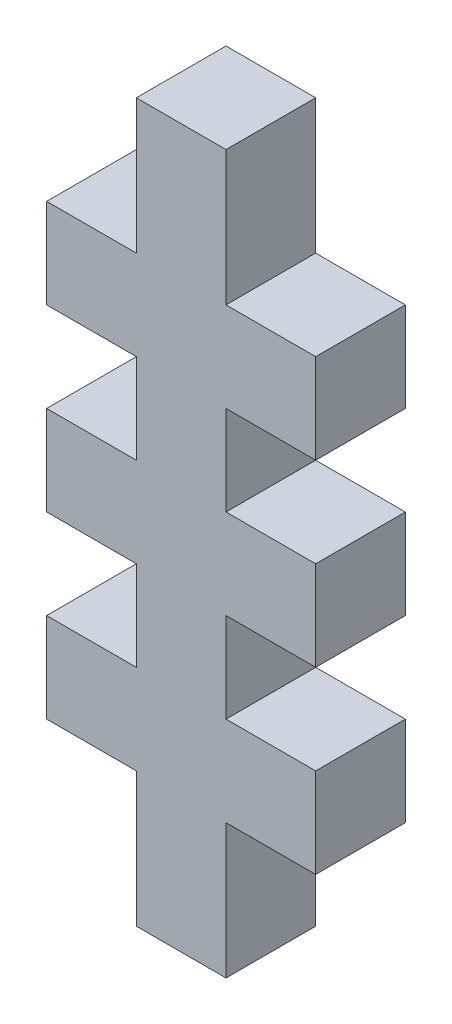
ISO-10303-21;
HEADER;
FILE_DESCRIPTION(('STEP AP214'),'2;1');
FILE_NAME('part.step','',(''),(''),'','','');
FILE_SCHEMA(('AUTOMOTIVE_DESIGN { 1 0 10303 214 1 1 1 1 }'));
ENDSEC;
DATA;
#1=APPLICATION_CONTEXT('core data for automotive mechanical design processes');
#2=APPLICATION_PROTOCOL_DEFINITION('international standard','automotive_design',2000,#1);
#3=PRODUCT_CONTEXT('',#1,'mechanical');
#4=PRODUCT('Part','Part','',(#3));
#5=PRODUCT_RELATED_PRODUCT_CATEGORY('part','',(#4));
#6=PRODUCT_DEFINITION_FORMATION('','',#4);
#7=PRODUCT_DEFINITION_CONTEXT('part definition',#1,'design');
#8=PRODUCT_DEFINITION('design','',#6,#7);
#9=PRODUCT_DEFINITION_SHAPE('','',#8);
#10=(LENGTH_UNIT() NAMED_UNIT(*) SI_UNIT(.MILLI.,.METRE.));
#11=(NAMED_UNIT(*) PLANE_ANGLE_UNIT() SI_UNIT($,.RADIAN.));
#12=(NAMED_UNIT(*) SI_UNIT($,.STERADIAN.) SOLID_ANGLE_UNIT());
#13=UNCERTAINTY_MEASURE_WITH_UNIT(LENGTH_MEASURE(1.E-05),#10,'distance_accuracy_value','');
#14=(GEOMETRIC_REPRESENTATION_CONTEXT(3) GLOBAL_UNCERTAINTY_ASSIGNED_CONTEXT((#13)) GLOBAL_UNIT_ASSIGNED_CONTEXT((#10,
#11,#12)) REPRESENTATION_CONTEXT('',''));
#15=CARTESIAN_POINT('',(0.,0.,0.));
#16=DIRECTION('',(0.,0.,1.));
#17=DIRECTION('',(1.,0.,0.));
#18=AXIS2_PLACEMENT_3D('',#15,#16,#17);
#19=CARTESIAN_POINT('',(7.5,20.,5.));
#20=DIRECTION('',(-1.,0.,0.));
#21=DIRECTION('',(0.,-1.,0.));
#22=AXIS2_PLACEMENT_3D('',#19,#20,#21);
#23=PLANE('',#22);
#24=DIRECTION('',(0.,1.,0.));
#25=VECTOR('',#24,1.);
#26=CARTESIAN_POINT('',(7.5,20.,0.));
#27=LINE('',#26,#25);
#28=CARTESIAN_POINT('',(7.5,-12.5,0.));
#29=VERTEX_POINT('',#28);
#30=CARTESIAN_POINT('',(7.5,-7.5,0.));
#31=VERTEX_POINT('',#30);
#32=EDGE_CURVE('E420',#29,#31,#27,.T.);
#33=ORIENTED_EDGE('',*,*,#32,.T.);
#34=DIRECTION('',(0.,0.,1.));
#35=VECTOR('',#34,1.);
#36=CARTESIAN_POINT('',(7.5,-7.5,0.));
#37=LINE('',#36,#35);
#38=CARTESIAN_POINT('',(7.5,-7.5,5.));
#39=VERTEX_POINT('',#38);
#40=EDGE_CURVE('E248',#31,#39,#37,.T.);
#41=ORIENTED_EDGE('',*,*,#40,.T.);
#42=DIRECTION('',(0.,1.,0.));
#43=VECTOR('',#42,1.);
#44=CARTESIAN_POINT('',(7.5,20.,5.));
#45=LINE('',#44,#43);
#46=CARTESIAN_POINT('',(7.5,-12.5,5.));
#47=VERTEX_POINT('',#46);
#48=EDGE_CURVE('E41',#47,#39,#45,.T.);
#49=ORIENTED_EDGE('',*,*,#48,.F.);
#50=DIRECTION('',(0.,0.,-1.));
#51=VECTOR('',#50,1.);
#52=CARTESIAN_POINT('',(7.5,-12.5,5.));
#53=LINE('',#52,#51);
#54=EDGE_CURVE('E340',#47,#29,#53,.T.);
#55=ORIENTED_EDGE('',*,*,#54,.T.);
#56=EDGE_LOOP('',(#33,#41,#49,#55));
#57=FACE_BOUND('',#56,.T.);
#58=ADVANCED_FACE('F32',(#57),#23,.F.);
#59=CARTESIAN_POINT('',(0.,0.,5.));
#60=DIRECTION('',(0.,0.,1.));
#61=DIRECTION('',(1.,0.,0.));
#62=AXIS2_PLACEMENT_3D('',#59,#60,#61);
#63=PLANE('',#62);
#64=DIRECTION('',(1.,0.,0.));
#65=VECTOR('',#64,1.);
#66=CARTESIAN_POINT('',(7.5,-7.5,5.));
#67=LINE('',#66,#65);
#68=CARTESIAN_POINT('',(2.5,-7.5,5.));
#69=VERTEX_POINT('',#68);
#70=EDGE_CURVE('E240',#69,#39,#67,.T.);
#71=ORIENTED_EDGE('',*,*,#70,.F.);
#72=DIRECTION('',(0.,-1.,0.));
#73=VECTOR('',#72,1.);
#74=CARTESIAN_POINT('',(2.5,-7.5,5.));
#75=LINE('',#74,#73);
#76=CARTESIAN_POINT('',(2.5,-2.5,5.));
#77=VERTEX_POINT('',#76);
#78=EDGE_CURVE('E242',#77,#69,#75,.T.);
#79=ORIENTED_EDGE('',*,*,#78,.F.);
#80=DIRECTION('',(-1.,0.,0.));
#81=VECTOR('',#80,1.);
#82=CARTESIAN_POINT('',(7.5,-2.5,5.));
#83=LINE('',#82,#81);
#84=CARTESIAN_POINT('',(7.5,-2.5,5.));
#85=VERTEX_POINT('',#84);
#86=EDGE_CURVE('E221',#85,#77,#83,.T.);
#87=ORIENTED_EDGE('',*,*,#86,.F.);
#88=CARTESIAN_POINT('',(7.5,2.5,5.));
#89=VERTEX_POINT('',#88);
#90=EDGE_CURVE('E411',#85,#89,#45,.T.);
#91=ORIENTED_EDGE('',*,*,#90,.T.);
#92=DIRECTION('',(-1.,0.,0.));
#93=VECTOR('',#92,1.);
#94=CARTESIAN_POINT('',(7.5,2.5,5.));
#95=LINE('',#94,#93);
#96=CARTESIAN_POINT('',(2.5,2.5,5.));
#97=VERTEX_POINT('',#96);
#98=EDGE_CURVE('E256',#89,#97,#95,.T.);
#99=ORIENTED_EDGE('',*,*,#98,.T.);
#100=DIRECTION('',(0.,1.,0.));
#101=VECTOR('',#100,1.);
#102=CARTESIAN_POINT('',(2.5,7.5,5.));
#103=LINE('',#102,#101);
#104=CARTESIAN_POINT('',(2.5,7.5,5.));
#105=VERTEX_POINT('',#104);
#106=EDGE_CURVE('E263',#97,#105,#103,.T.);
#107=ORIENTED_EDGE('',*,*,#106,.T.);
#108=DIRECTION('',(1.,0.,0.));
#109=VECTOR('',#108,1.);
#110=CARTESIAN_POINT('',(7.5,7.5,5.));
#111=LINE('',#110,#109);
#112=CARTESIAN_POINT('',(7.5,7.5,5.));
#113=VERTEX_POINT('',#112);
#114=EDGE_CURVE('E251',#105,#113,#111,.T.);
#115=ORIENTED_EDGE('',*,*,#114,.T.);
#116=CARTESIAN_POINT('',(7.5,12.5,5.));
#117=VERTEX_POINT('',#116);
#118=EDGE_CURVE('E409',#113,#117,#45,.T.);
#119=ORIENTED_EDGE('',*,*,#118,.T.);
#120=DIRECTION('',(-1.,0.,0.));
#121=VECTOR('',#120,1.);
#122=CARTESIAN_POINT('',(7.5,12.5,5.));
#123=LINE('',#122,#121);
#124=CARTESIAN_POINT('',(2.5,12.5,5.));
#125=VERTEX_POINT('',#124);
#126=EDGE_CURVE('E347',#117,#125,#123,.T.);
#127=ORIENTED_EDGE('',*,*,#126,.T.);
#128=DIRECTION('',(0.,1.,0.));
#129=VECTOR('',#128,1.);
#130=CARTESIAN_POINT('',(2.5,20.,5.));
#131=LINE('',#130,#129);
#132=CARTESIAN_POINT('',(2.5,20.,5.));
#133=VERTEX_POINT('',#132);
#134=EDGE_CURVE('E344',#125,#133,#131,.T.);
#135=ORIENTED_EDGE('',*,*,#134,.T.);
#136=DIRECTION('',(-1.,0.,0.));
#137=VECTOR('',#136,1.);
#138=CARTESIAN_POINT('',(-7.5,20.,5.));
#139=LINE('',#138,#137);
#140=CARTESIAN_POINT('',(-2.5,20.,5.));
#141=VERTEX_POINT('',#140);
#142=EDGE_CURVE('E11',#133,#141,#139,.T.);
#143=ORIENTED_EDGE('',*,*,#142,.T.);
#144=DIRECTION('',(0.,1.,0.));
#145=VECTOR('',#144,1.);
#146=CARTESIAN_POINT('',(-2.5,20.,5.));
#147=LINE('',#146,#145);
#148=CARTESIAN_POINT('',(-2.5,12.5,5.));
#149=VERTEX_POINT('',#148);
#150=EDGE_CURVE('E384',#149,#141,#147,.T.);
#151=ORIENTED_EDGE('',*,*,#150,.F.);
#152=DIRECTION('',(1.,0.,0.));
#153=VECTOR('',#152,1.);
#154=CARTESIAN_POINT('',(-7.5,12.5,5.));
#155=LINE('',#154,#153);
#156=CARTESIAN_POINT('',(-7.5,12.5,5.));
#157=VERTEX_POINT('',#156);
#158=EDGE_CURVE('E382',#157,#149,#155,.T.);
#159=ORIENTED_EDGE('',*,*,#158,.F.);
#160=DIRECTION('',(0.,-1.,0.));
#161=VECTOR('',#160,1.);
#162=CARTESIAN_POINT('',(-7.5,20.,5.));
#163=LINE('',#162,#161);
#164=CARTESIAN_POINT('',(-7.5,7.5,5.));
#165=VERTEX_POINT('',#164);
#166=EDGE_CURVE('E401',#157,#165,#163,.T.);
#167=ORIENTED_EDGE('',*,*,#166,.T.);
#168=DIRECTION('',(-1.,0.,0.));
#169=VECTOR('',#168,1.);
#170=CARTESIAN_POINT('',(-7.5,7.5,5.));
#171=LINE('',#170,#169);
#172=CARTESIAN_POINT('',(-2.5,7.5,5.));
#173=VERTEX_POINT('',#172);
#174=EDGE_CURVE('E305',#173,#165,#171,.T.);
#175=ORIENTED_EDGE('',*,*,#174,.F.);
#176=DIRECTION('',(0.,1.,0.));
#177=VECTOR('',#176,1.);
#178=CARTESIAN_POINT('',(-2.5,7.5,5.));
#179=LINE('',#178,#177);
#180=CARTESIAN_POINT('',(-2.5,2.5,5.));
#181=VERTEX_POINT('',#180);
#182=EDGE_CURVE('E314',#181,#173,#179,.T.);
#183=ORIENTED_EDGE('',*,*,#182,.F.);
#184=DIRECTION('',(1.,0.,0.));
#185=VECTOR('',#184,1.);
#186=CARTESIAN_POINT('',(-7.5,2.5,5.));
#187=LINE('',#186,#185);
#188=CARTESIAN_POINT('',(-7.5,2.5,5.));
#189=VERTEX_POINT('',#188);
#190=EDGE_CURVE('E295',#189,#181,#187,.T.);
#191=ORIENTED_EDGE('',*,*,#190,.F.);
#192=CARTESIAN_POINT('',(-7.5,-2.5,5.));
#193=VERTEX_POINT('',#192);
#194=EDGE_CURVE('E405',#189,#193,#163,.T.);
#195=ORIENTED_EDGE('',*,*,#194,.T.);
#196=DIRECTION('',(1.,0.,0.));
#197=VECTOR('',#196,1.);
#198=CARTESIAN_POINT('',(-7.5,-2.5,5.));
#199=LINE('',#198,#197);
#200=CARTESIAN_POINT('',(-2.5,-2.5,5.));
#201=VERTEX_POINT('',#200);
#202=EDGE_CURVE('E280',#193,#201,#199,.T.);
#203=ORIENTED_EDGE('',*,*,#202,.T.);
#204=DIRECTION('',(0.,-1.,0.));
#205=VECTOR('',#204,1.);
#206=CARTESIAN_POINT('',(-2.5,-7.5,5.));
#207=LINE('',#206,#205);
#208=CARTESIAN_POINT('',(-2.5,-7.5,5.));
#209=VERTEX_POINT('',#208);
#210=EDGE_CURVE('E287',#201,#209,#207,.T.);
#211=ORIENTED_EDGE('',*,*,#210,.T.);
#212=DIRECTION('',(-1.,0.,0.));
#213=VECTOR('',#212,1.);
#214=CARTESIAN_POINT('',(-7.5,-7.5,5.));
#215=LINE('',#214,#213);
#216=CARTESIAN_POINT('',(-7.5,-7.5,5.));
#217=VERTEX_POINT('',#216);
#218=EDGE_CURVE('E271',#209,#217,#215,.T.);
#219=ORIENTED_EDGE('',*,*,#218,.T.);
#220=CARTESIAN_POINT('',(-7.5,-12.5,5.));
#221=VERTEX_POINT('',#220);
#222=EDGE_CURVE('E406',#217,#221,#163,.T.);
#223=ORIENTED_EDGE('',*,*,#222,.T.);
#224=DIRECTION('',(1.,0.,0.));
#225=VECTOR('',#224,1.);
#226=CARTESIAN_POINT('',(-7.5,-12.5,5.));
#227=LINE('',#226,#225);
#228=CARTESIAN_POINT('',(-2.5,-12.5,5.));
#229=VERTEX_POINT('',#228);
#230=EDGE_CURVE('E366',#221,#229,#227,.T.);
#231=ORIENTED_EDGE('',*,*,#230,.T.);
#232=DIRECTION('',(0.,-1.,0.));
#233=VECTOR('',#232,1.);
#234=CARTESIAN_POINT('',(-2.5,-20.,5.));
#235=LINE('',#234,#233);
#236=CARTESIAN_POINT('',(-2.5,-20.,5.));
#237=VERTEX_POINT('',#236);
#238=EDGE_CURVE('E363',#229,#237,#235,.T.);
#239=ORIENTED_EDGE('',*,*,#238,.T.);
#240=DIRECTION('',(1.,0.,0.));
#241=VECTOR('',#240,1.);
#242=CARTESIAN_POINT('',(-7.5,-20.,5.));
#243=LINE('',#242,#241);
#244=CARTESIAN_POINT('',(2.5,-20.,5.));
#245=VERTEX_POINT('',#244);
#246=EDGE_CURVE('E404',#237,#245,#243,.T.);
#247=ORIENTED_EDGE('',*,*,#246,.T.);
#248=DIRECTION('',(0.,-1.,0.));
#249=VECTOR('',#248,1.);
#250=CARTESIAN_POINT('',(2.5,-20.,5.));
#251=LINE('',#250,#249);
#252=CARTESIAN_POINT('',(2.5,-12.5,5.));
#253=VERTEX_POINT('',#252);
#254=EDGE_CURVE('E329',#253,#245,#251,.T.);
#255=ORIENTED_EDGE('',*,*,#254,.F.);
#256=DIRECTION('',(-1.,0.,0.));
#257=VECTOR('',#256,1.);
#258=CARTESIAN_POINT('',(7.5,-12.5,5.));
#259=LINE('',#258,#257);
#260=EDGE_CURVE('E327',#47,#253,#259,.T.);
#261=ORIENTED_EDGE('',*,*,#260,.F.);
#262=ORIENTED_EDGE('',*,*,#48,.T.);
#263=EDGE_LOOP('',(#71,#79,#87,#91,#99,#107,#115,#119,#127,#135,#143,#151,#159,#167,#175,#183,
#191,#195,#203,#211,#219,#223,#231,#239,#247,#255,#261,#262));
#264=FACE_BOUND('',#263,.T.);
#265=ADVANCED_FACE('F445',(#264),#63,.T.);
#266=CARTESIAN_POINT('',(0.,0.,0.));
#267=DIRECTION('',(0.,0.,1.));
#268=DIRECTION('',(1.,0.,0.));
#269=AXIS2_PLACEMENT_3D('',#266,#267,#268);
#270=PLANE('',#269);
#271=DIRECTION('',(0.,-1.,0.));
#272=VECTOR('',#271,1.);
#273=CARTESIAN_POINT('',(2.5,-7.5,0.));
#274=LINE('',#273,#272);
#275=CARTESIAN_POINT('',(2.5,-2.5,0.));
#276=VERTEX_POINT('',#275);
#277=CARTESIAN_POINT('',(2.5,-7.5,0.));
#278=VERTEX_POINT('',#277);
#279=EDGE_CURVE('E229',#276,#278,#274,.T.);
#280=ORIENTED_EDGE('',*,*,#279,.T.);
#281=DIRECTION('',(1.,0.,0.));
#282=VECTOR('',#281,1.);
#283=CARTESIAN_POINT('',(7.5,-7.5,0.));
#284=LINE('',#283,#282);
#285=EDGE_CURVE('E234',#278,#31,#284,.T.);
#286=ORIENTED_EDGE('',*,*,#285,.T.);
#287=ORIENTED_EDGE('',*,*,#32,.F.);
#288=DIRECTION('',(-1.,0.,0.));
#289=VECTOR('',#288,1.);
#290=CARTESIAN_POINT('',(7.5,-12.5,0.));
#291=LINE('',#290,#289);
#292=CARTESIAN_POINT('',(2.5,-12.5,0.));
#293=VERTEX_POINT('',#292);
#294=EDGE_CURVE('E321',#29,#293,#291,.T.);
#295=ORIENTED_EDGE('',*,*,#294,.T.);
#296=DIRECTION('',(0.,-1.,0.));
#297=VECTOR('',#296,1.);
#298=CARTESIAN_POINT('',(2.5,-20.,0.));
#299=LINE('',#298,#297);
#300=CARTESIAN_POINT('',(2.5,-20.,0.));
#301=VERTEX_POINT('',#300);
#302=EDGE_CURVE('E330',#293,#301,#299,.T.);
#303=ORIENTED_EDGE('',*,*,#302,.T.);
#304=DIRECTION('',(1.,0.,0.));
#305=VECTOR('',#304,1.);
#306=CARTESIAN_POINT('',(-7.5,-20.,0.));
#307=LINE('',#306,#305);
#308=CARTESIAN_POINT('',(-2.5,-20.,0.));
#309=VERTEX_POINT('',#308);
#310=EDGE_CURVE('E416',#309,#301,#307,.T.);
#311=ORIENTED_EDGE('',*,*,#310,.F.);
#312=DIRECTION('',(0.,-1.,0.));
#313=VECTOR('',#312,1.);
#314=CARTESIAN_POINT('',(-2.5,-20.,0.));
#315=LINE('',#314,#313);
#316=CARTESIAN_POINT('',(-2.5,-12.5,0.));
#317=VERTEX_POINT('',#316);
#318=EDGE_CURVE('E362',#317,#309,#315,.T.);
#319=ORIENTED_EDGE('',*,*,#318,.F.);
#320=DIRECTION('',(1.,0.,0.));
#321=VECTOR('',#320,1.);
#322=CARTESIAN_POINT('',(-7.5,-12.5,0.));
#323=LINE('',#322,#321);
#324=CARTESIAN_POINT('',(-7.5,-12.5,0.));
#325=VERTEX_POINT('',#324);
#326=EDGE_CURVE('E367',#325,#317,#323,.T.);
#327=ORIENTED_EDGE('',*,*,#326,.F.);
#328=DIRECTION('',(0.,-1.,0.));
#329=VECTOR('',#328,1.);
#330=CARTESIAN_POINT('',(-7.5,20.,0.));
#331=LINE('',#330,#329);
#332=CARTESIAN_POINT('',(-7.5,-7.5,0.));
#333=VERTEX_POINT('',#332);
#334=EDGE_CURVE('E400',#333,#325,#331,.T.);
#335=ORIENTED_EDGE('',*,*,#334,.F.);
#336=DIRECTION('',(-1.,0.,0.));
#337=VECTOR('',#336,1.);
#338=CARTESIAN_POINT('',(-7.5,-7.5,0.));
#339=LINE('',#338,#337);
#340=CARTESIAN_POINT('',(-2.5,-7.5,0.));
#341=VERTEX_POINT('',#340);
#342=EDGE_CURVE('E277',#341,#333,#339,.T.);
#343=ORIENTED_EDGE('',*,*,#342,.F.);
#344=DIRECTION('',(0.,-1.,0.));
#345=VECTOR('',#344,1.);
#346=CARTESIAN_POINT('',(-2.5,-7.5,0.));
#347=LINE('',#346,#345);
#348=CARTESIAN_POINT('',(-2.5,-2.5,0.));
#349=VERTEX_POINT('',#348);
#350=EDGE_CURVE('E279',#349,#341,#347,.T.);
#351=ORIENTED_EDGE('',*,*,#350,.F.);
#352=DIRECTION('',(1.,0.,0.));
#353=VECTOR('',#352,1.);
#354=CARTESIAN_POINT('',(-7.5,-2.5,0.));
#355=LINE('',#354,#353);
#356=CARTESIAN_POINT('',(-7.5,-2.5,0.));
#357=VERTEX_POINT('',#356);
#358=EDGE_CURVE('E282',#357,#349,#355,.T.);
#359=ORIENTED_EDGE('',*,*,#358,.F.);
#360=CARTESIAN_POINT('',(-7.5,2.50000000000001,0.));
#361=VERTEX_POINT('',#360);
#362=EDGE_CURVE('E417',#361,#357,#331,.T.);
#363=ORIENTED_EDGE('',*,*,#362,.F.);
#364=DIRECTION('',(1.,0.,0.));
#365=VECTOR('',#364,1.);
#366=CARTESIAN_POINT('',(-7.5,2.5,0.));
#367=LINE('',#366,#365);
#368=CARTESIAN_POINT('',(-2.5,2.5,0.));
#369=VERTEX_POINT('',#368);
#370=EDGE_CURVE('E301',#361,#369,#367,.T.);
#371=ORIENTED_EDGE('',*,*,#370,.T.);
#372=DIRECTION('',(0.,1.,0.));
#373=VECTOR('',#372,1.);
#374=CARTESIAN_POINT('',(-2.5,7.5,0.));
#375=LINE('',#374,#373);
#376=CARTESIAN_POINT('',(-2.5,7.5,0.));
#377=VERTEX_POINT('',#376);
#378=EDGE_CURVE('E304',#369,#377,#375,.T.);
#379=ORIENTED_EDGE('',*,*,#378,.T.);
#380=DIRECTION('',(-1.,0.,0.));
#381=VECTOR('',#380,1.);
#382=CARTESIAN_POINT('',(-7.5,7.5,0.));
#383=LINE('',#382,#381);
#384=CARTESIAN_POINT('',(-7.5,7.5,0.));
#385=VERTEX_POINT('',#384);
#386=EDGE_CURVE('E308',#377,#385,#383,.T.);
#387=ORIENTED_EDGE('',*,*,#386,.T.);
#388=CARTESIAN_POINT('',(-7.5,12.5,0.));
#389=VERTEX_POINT('',#388);
#390=EDGE_CURVE('E413',#389,#385,#331,.T.);
#391=ORIENTED_EDGE('',*,*,#390,.F.);
#392=DIRECTION('',(1.,0.,0.));
#393=VECTOR('',#392,1.);
#394=CARTESIAN_POINT('',(-7.5,12.5,0.));
#395=LINE('',#394,#393);
#396=CARTESIAN_POINT('',(-2.5,12.5,0.));
#397=VERTEX_POINT('',#396);
#398=EDGE_CURVE('E381',#389,#397,#395,.T.);
#399=ORIENTED_EDGE('',*,*,#398,.T.);
#400=DIRECTION('',(0.,1.,0.));
#401=VECTOR('',#400,1.);
#402=CARTESIAN_POINT('',(-2.5,20.,0.));
#403=LINE('',#402,#401);
#404=CARTESIAN_POINT('',(-2.5,20.,0.));
#405=VERTEX_POINT('',#404);
#406=EDGE_CURVE('E385',#397,#405,#403,.T.);
#407=ORIENTED_EDGE('',*,*,#406,.T.);
#408=DIRECTION('',(-1.,0.,0.));
#409=VECTOR('',#408,1.);
#410=CARTESIAN_POINT('',(-7.5,20.,0.));
#411=LINE('',#410,#409);
#412=CARTESIAN_POINT('',(2.5,20.,0.));
#413=VERTEX_POINT('',#412);
#414=EDGE_CURVE('E36',#413,#405,#411,.T.);
#415=ORIENTED_EDGE('',*,*,#414,.F.);
#416=DIRECTION('',(0.,1.,0.));
#417=VECTOR('',#416,1.);
#418=CARTESIAN_POINT('',(2.5,20.,0.));
#419=LINE('',#418,#417);
#420=CARTESIAN_POINT('',(2.5,12.5,0.));
#421=VERTEX_POINT('',#420);
#422=EDGE_CURVE('E343',#421,#413,#419,.T.);
#423=ORIENTED_EDGE('',*,*,#422,.F.);
#424=DIRECTION('',(-1.,0.,0.));
#425=VECTOR('',#424,1.);
#426=CARTESIAN_POINT('',(7.5,12.5,0.));
#427=LINE('',#426,#425);
#428=CARTESIAN_POINT('',(7.5,12.5,0.));
#429=VERTEX_POINT('',#428);
#430=EDGE_CURVE('E348',#429,#421,#427,.T.);
#431=ORIENTED_EDGE('',*,*,#430,.F.);
#432=CARTESIAN_POINT('',(7.5,7.50000000000001,0.));
#433=VERTEX_POINT('',#432);
#434=EDGE_CURVE('E419',#433,#429,#27,.T.);
#435=ORIENTED_EDGE('',*,*,#434,.F.);
#436=DIRECTION('',(1.,0.,0.));
#437=VECTOR('',#436,1.);
#438=CARTESIAN_POINT('',(7.5,7.5,0.));
#439=LINE('',#438,#437);
#440=CARTESIAN_POINT('',(2.5,7.5,0.));
#441=VERTEX_POINT('',#440);
#442=EDGE_CURVE('E57',#441,#433,#439,.T.);
#443=ORIENTED_EDGE('',*,*,#442,.F.);
#444=DIRECTION('',(0.,1.,0.));
#445=VECTOR('',#444,1.);
#446=CARTESIAN_POINT('',(2.5,7.5,0.));
#447=LINE('',#446,#445);
#448=CARTESIAN_POINT('',(2.5,2.5,0.));
#449=VERTEX_POINT('',#448);
#450=EDGE_CURVE('E255',#449,#441,#447,.T.);
#451=ORIENTED_EDGE('',*,*,#450,.F.);
#452=DIRECTION('',(-1.,0.,0.));
#453=VECTOR('',#452,1.);
#454=CARTESIAN_POINT('',(7.5,2.5,0.));
#455=LINE('',#454,#453);
#456=CARTESIAN_POINT('',(7.5,2.5,0.));
#457=VERTEX_POINT('',#456);
#458=EDGE_CURVE('E258',#457,#449,#455,.T.);
#459=ORIENTED_EDGE('',*,*,#458,.F.);
#460=CARTESIAN_POINT('',(7.5,-2.50000000000001,0.));
#461=VERTEX_POINT('',#460);
#462=EDGE_CURVE('E239',#461,#457,#27,.T.);
#463=ORIENTED_EDGE('',*,*,#462,.F.);
#464=DIRECTION('',(-1.,0.,0.));
#465=VECTOR('',#464,1.);
#466=CARTESIAN_POINT('',(7.5,-2.5,0.));
#467=LINE('',#466,#465);
#468=EDGE_CURVE('E49',#461,#276,#467,.T.);
#469=ORIENTED_EDGE('',*,*,#468,.T.);
#470=EDGE_LOOP('',(#280,#286,#287,#295,#303,#311,#319,#327,#335,#343,#351,#359,#363,#371,#379,
#387,#391,#399,#407,#415,#423,#431,#435,#443,#451,#459,#463,#469));
#471=FACE_BOUND('',#470,.T.);
#472=ADVANCED_FACE('F237',(#471),#270,.F.);
#473=ORIENTED_EDGE('',*,*,#90,.F.);
#474=DIRECTION('',(0.,0.,1.));
#475=VECTOR('',#474,1.);
#476=CARTESIAN_POINT('',(7.5,-2.5,0.));
#477=LINE('',#476,#475);
#478=EDGE_CURVE('E226',#461,#85,#477,.T.);
#479=ORIENTED_EDGE('',*,*,#478,.F.);
#480=ORIENTED_EDGE('',*,*,#462,.T.);
#481=DIRECTION('',(0.,0.,1.));
#482=VECTOR('',#481,1.);
#483=CARTESIAN_POINT('',(7.5,2.5,0.));
#484=LINE('',#483,#482);
#485=EDGE_CURVE('E268',#457,#89,#484,.T.);
#486=ORIENTED_EDGE('',*,*,#485,.T.);
#487=EDGE_LOOP('',(#473,#479,#480,#486));
#488=FACE_BOUND('',#487,.T.);
#489=ADVANCED_FACE('F511',(#488),#23,.F.);
#490=DIRECTION('',(0.,0.,1.));
#491=VECTOR('',#490,1.);
#492=CARTESIAN_POINT('',(7.5,7.5,0.));
#493=LINE('',#492,#491);
#494=EDGE_CURVE('E260',#433,#113,#493,.T.);
#495=ORIENTED_EDGE('',*,*,#494,.F.);
#496=ORIENTED_EDGE('',*,*,#434,.T.);
#497=DIRECTION('',(0.,0.,-1.));
#498=VECTOR('',#497,1.);
#499=CARTESIAN_POINT('',(7.5,12.5,5.));
#500=LINE('',#499,#498);
#501=EDGE_CURVE('E351',#117,#429,#500,.T.);
#502=ORIENTED_EDGE('',*,*,#501,.F.);
#503=ORIENTED_EDGE('',*,*,#118,.F.);
#504=EDGE_LOOP('',(#495,#496,#502,#503));
#505=FACE_BOUND('',#504,.T.);
#506=ADVANCED_FACE('F427',(#505),#23,.F.);
#507=CARTESIAN_POINT('',(-7.5,20.,5.));
#508=DIRECTION('',(1.,0.,0.));
#509=DIRECTION('',(0.,1.,0.));
#510=AXIS2_PLACEMENT_3D('',#507,#508,#509);
#511=PLANE('',#510);
#512=DIRECTION('',(0.,0.,1.));
#513=VECTOR('',#512,1.);
#514=CARTESIAN_POINT('',(-7.5,-2.5,0.));
#515=LINE('',#514,#513);
#516=EDGE_CURVE('E292',#357,#193,#515,.T.);
#517=ORIENTED_EDGE('',*,*,#516,.T.);
#518=ORIENTED_EDGE('',*,*,#194,.F.);
#519=DIRECTION('',(0.,0.,1.));
#520=VECTOR('',#519,1.);
#521=CARTESIAN_POINT('',(-7.5,2.5,0.));
#522=LINE('',#521,#520);
#523=EDGE_CURVE('E311',#361,#189,#522,.T.);
#524=ORIENTED_EDGE('',*,*,#523,.F.);
#525=ORIENTED_EDGE('',*,*,#362,.T.);
#526=EDGE_LOOP('',(#517,#518,#524,#525));
#527=FACE_BOUND('',#526,.T.);
#528=ADVANCED_FACE('F34',(#527),#511,.F.);
#529=DIRECTION('',(0.,0.,1.));
#530=VECTOR('',#529,1.);
#531=CARTESIAN_POINT('',(-7.5,-7.5,0.));
#532=LINE('',#531,#530);
#533=EDGE_CURVE('E284',#333,#217,#532,.T.);
#534=ORIENTED_EDGE('',*,*,#533,.F.);
#535=ORIENTED_EDGE('',*,*,#334,.T.);
#536=DIRECTION('',(0.,0.,-1.));
#537=VECTOR('',#536,1.);
#538=CARTESIAN_POINT('',(-7.5,-12.5,5.));
#539=LINE('',#538,#537);
#540=EDGE_CURVE('E370',#221,#325,#539,.T.);
#541=ORIENTED_EDGE('',*,*,#540,.F.);
#542=ORIENTED_EDGE('',*,*,#222,.F.);
#543=EDGE_LOOP('',(#534,#535,#541,#542));
#544=FACE_BOUND('',#543,.T.);
#545=ADVANCED_FACE('F483',(#544),#511,.F.);
#546=ORIENTED_EDGE('',*,*,#390,.T.);
#547=DIRECTION('',(0.,0.,1.));
#548=VECTOR('',#547,1.);
#549=CARTESIAN_POINT('',(-7.5,7.5,0.));
#550=LINE('',#549,#548);
#551=EDGE_CURVE('E318',#385,#165,#550,.T.);
#552=ORIENTED_EDGE('',*,*,#551,.T.);
#553=ORIENTED_EDGE('',*,*,#166,.F.);
#554=DIRECTION('',(0.,0.,-1.));
#555=VECTOR('',#554,1.);
#556=CARTESIAN_POINT('',(-7.5,12.5,5.));
#557=LINE('',#556,#555);
#558=EDGE_CURVE('E397',#157,#389,#557,.T.);
#559=ORIENTED_EDGE('',*,*,#558,.T.);
#560=EDGE_LOOP('',(#546,#552,#553,#559));
#561=FACE_BOUND('',#560,.T.);
#562=ADVANCED_FACE('F456',(#561),#511,.F.);
#563=CARTESIAN_POINT('',(-7.5,-20.,5.));
#564=DIRECTION('',(0.,1.,0.));
#565=DIRECTION('',(0.,0.,1.));
#566=AXIS2_PLACEMENT_3D('',#563,#564,#565);
#567=PLANE('',#566);
#568=DIRECTION('',(0.,0.,-1.));
#569=VECTOR('',#568,1.);
#570=CARTESIAN_POINT('',(2.5,-20.,5.));
#571=LINE('',#570,#569);
#572=EDGE_CURVE('E332',#245,#301,#571,.T.);
#573=ORIENTED_EDGE('',*,*,#572,.F.);
#574=ORIENTED_EDGE('',*,*,#246,.F.);
#575=DIRECTION('',(0.,0.,-1.));
#576=VECTOR('',#575,1.);
#577=CARTESIAN_POINT('',(-2.5,-20.,5.));
#578=LINE('',#577,#576);
#579=EDGE_CURVE('E378',#237,#309,#578,.T.);
#580=ORIENTED_EDGE('',*,*,#579,.T.);
#581=ORIENTED_EDGE('',*,*,#310,.T.);
#582=EDGE_LOOP('',(#573,#574,#580,#581));
#583=FACE_BOUND('',#582,.T.);
#584=ADVANCED_FACE('F575',(#583),#567,.F.);
#585=CARTESIAN_POINT('',(-7.5,20.,5.));
#586=DIRECTION('',(0.,-1.,0.));
#587=DIRECTION('',(0.,0.,-1.));
#588=AXIS2_PLACEMENT_3D('',#585,#586,#587);
#589=PLANE('',#588);
#590=ORIENTED_EDGE('',*,*,#142,.F.);
#591=DIRECTION('',(0.,0.,-1.));
#592=VECTOR('',#591,1.);
#593=CARTESIAN_POINT('',(2.5,20.,5.));
#594=LINE('',#593,#592);
#595=EDGE_CURVE('E359',#133,#413,#594,.T.);
#596=ORIENTED_EDGE('',*,*,#595,.T.);
#597=ORIENTED_EDGE('',*,*,#414,.T.);
#598=DIRECTION('',(0.,0.,-1.));
#599=VECTOR('',#598,1.);
#600=CARTESIAN_POINT('',(-2.5,20.,5.));
#601=LINE('',#600,#599);
#602=EDGE_CURVE('E388',#141,#405,#601,.T.);
#603=ORIENTED_EDGE('',*,*,#602,.F.);
#604=EDGE_LOOP('',(#590,#596,#597,#603));
#605=FACE_BOUND('',#604,.T.);
#606=ADVANCED_FACE('F440',(#605),#589,.F.);
#607=CARTESIAN_POINT('',(-7.5,12.5,5.));
#608=DIRECTION('',(0.,1.,0.));
#609=DIRECTION('',(0.,0.,1.));
#610=AXIS2_PLACEMENT_3D('',#607,#608,#609);
#611=PLANE('',#610);
#612=ORIENTED_EDGE('',*,*,#398,.F.);
#613=ORIENTED_EDGE('',*,*,#558,.F.);
#614=ORIENTED_EDGE('',*,*,#158,.T.);
#615=DIRECTION('',(0.,0.,-1.));
#616=VECTOR('',#615,1.);
#617=CARTESIAN_POINT('',(-2.5,12.5,5.));
#618=LINE('',#617,#616);
#619=EDGE_CURVE('E395',#149,#397,#618,.T.);
#620=ORIENTED_EDGE('',*,*,#619,.T.);
#621=EDGE_LOOP('',(#612,#613,#614,#620));
#622=FACE_BOUND('',#621,.T.);
#623=ADVANCED_FACE('F452',(#622),#611,.T.);
#624=CARTESIAN_POINT('',(-2.5,20.,5.));
#625=DIRECTION('',(-1.,0.,0.));
#626=DIRECTION('',(0.,-1.,0.));
#627=AXIS2_PLACEMENT_3D('',#624,#625,#626);
#628=PLANE('',#627);
#629=ORIENTED_EDGE('',*,*,#406,.F.);
#630=ORIENTED_EDGE('',*,*,#619,.F.);
#631=ORIENTED_EDGE('',*,*,#150,.T.);
#632=ORIENTED_EDGE('',*,*,#602,.T.);
#633=EDGE_LOOP('',(#629,#630,#631,#632));
#634=FACE_BOUND('',#633,.T.);
#635=ADVANCED_FACE('F450',(#634),#628,.T.);
#636=CARTESIAN_POINT('',(-2.5,-20.,5.));
#637=DIRECTION('',(1.,0.,0.));
#638=DIRECTION('',(0.,1.,0.));
#639=AXIS2_PLACEMENT_3D('',#636,#637,#638);
#640=PLANE('',#639);
#641=ORIENTED_EDGE('',*,*,#318,.T.);
#642=ORIENTED_EDGE('',*,*,#579,.F.);
#643=ORIENTED_EDGE('',*,*,#238,.F.);
#644=DIRECTION('',(0.,0.,-1.));
#645=VECTOR('',#644,1.);
#646=CARTESIAN_POINT('',(-2.5,-12.5,5.));
#647=LINE('',#646,#645);
#648=EDGE_CURVE('E376',#229,#317,#647,.T.);
#649=ORIENTED_EDGE('',*,*,#648,.T.);
#650=EDGE_LOOP('',(#641,#642,#643,#649));
#651=FACE_BOUND('',#650,.T.);
#652=ADVANCED_FACE('F567',(#651),#640,.F.);
#653=CARTESIAN_POINT('',(-7.5,-12.5,5.));
#654=DIRECTION('',(0.,1.,0.));
#655=DIRECTION('',(0.,0.,1.));
#656=AXIS2_PLACEMENT_3D('',#653,#654,#655);
#657=PLANE('',#656);
#658=ORIENTED_EDGE('',*,*,#326,.T.);
#659=ORIENTED_EDGE('',*,*,#648,.F.);
#660=ORIENTED_EDGE('',*,*,#230,.F.);
#661=ORIENTED_EDGE('',*,*,#540,.T.);
#662=EDGE_LOOP('',(#658,#659,#660,#661));
#663=FACE_BOUND('',#662,.T.);
#664=ADVANCED_FACE('F480',(#663),#657,.F.);
#665=CARTESIAN_POINT('',(2.5,20.,5.));
#666=DIRECTION('',(-1.,0.,0.));
#667=DIRECTION('',(0.,-1.,0.));
#668=AXIS2_PLACEMENT_3D('',#665,#666,#667);
#669=PLANE('',#668);
#670=ORIENTED_EDGE('',*,*,#422,.T.);
#671=ORIENTED_EDGE('',*,*,#595,.F.);
#672=ORIENTED_EDGE('',*,*,#134,.F.);
#673=DIRECTION('',(0.,0.,-1.));
#674=VECTOR('',#673,1.);
#675=CARTESIAN_POINT('',(2.5,12.5,5.));
#676=LINE('',#675,#674);
#677=EDGE_CURVE('E357',#125,#421,#676,.T.);
#678=ORIENTED_EDGE('',*,*,#677,.T.);
#679=EDGE_LOOP('',(#670,#671,#672,#678));
#680=FACE_BOUND('',#679,.T.);
#681=ADVANCED_FACE('F436',(#680),#669,.F.);
#682=CARTESIAN_POINT('',(7.5,12.5,5.));
#683=DIRECTION('',(0.,-1.,0.));
#684=DIRECTION('',(0.,0.,-1.));
#685=AXIS2_PLACEMENT_3D('',#682,#683,#684);
#686=PLANE('',#685);
#687=ORIENTED_EDGE('',*,*,#430,.T.);
#688=ORIENTED_EDGE('',*,*,#677,.F.);
#689=ORIENTED_EDGE('',*,*,#126,.F.);
#690=ORIENTED_EDGE('',*,*,#501,.T.);
#691=EDGE_LOOP('',(#687,#688,#689,#690));
#692=FACE_BOUND('',#691,.T.);
#693=ADVANCED_FACE('F432',(#692),#686,.F.);
#694=CARTESIAN_POINT('',(7.5,-12.5,5.));
#695=DIRECTION('',(0.,-1.,0.));
#696=DIRECTION('',(0.,0.,-1.));
#697=AXIS2_PLACEMENT_3D('',#694,#695,#696);
#698=PLANE('',#697);
#699=ORIENTED_EDGE('',*,*,#294,.F.);
#700=ORIENTED_EDGE('',*,*,#54,.F.);
#701=ORIENTED_EDGE('',*,*,#260,.T.);
#702=DIRECTION('',(0.,0.,-1.));
#703=VECTOR('',#702,1.);
#704=CARTESIAN_POINT('',(2.5,-12.5,5.));
#705=LINE('',#704,#703);
#706=EDGE_CURVE('E338',#253,#293,#705,.T.);
#707=ORIENTED_EDGE('',*,*,#706,.T.);
#708=EDGE_LOOP('',(#699,#700,#701,#707));
#709=FACE_BOUND('',#708,.T.);
#710=ADVANCED_FACE('F556',(#709),#698,.T.);
#711=CARTESIAN_POINT('',(2.5,-20.,5.));
#712=DIRECTION('',(1.,0.,0.));
#713=DIRECTION('',(0.,1.,0.));
#714=AXIS2_PLACEMENT_3D('',#711,#712,#713);
#715=PLANE('',#714);
#716=ORIENTED_EDGE('',*,*,#302,.F.);
#717=ORIENTED_EDGE('',*,*,#706,.F.);
#718=ORIENTED_EDGE('',*,*,#254,.T.);
#719=ORIENTED_EDGE('',*,*,#572,.T.);
#720=EDGE_LOOP('',(#716,#717,#718,#719));
#721=FACE_BOUND('',#720,.T.);
#722=ADVANCED_FACE('F553',(#721),#715,.T.);
#723=CARTESIAN_POINT('',(-7.5,7.5,0.));
#724=DIRECTION('',(0.,1.,0.));
#725=DIRECTION('',(0.,0.,1.));
#726=AXIS2_PLACEMENT_3D('',#723,#724,#725);
#727=PLANE('',#726);
#728=ORIENTED_EDGE('',*,*,#174,.T.);
#729=ORIENTED_EDGE('',*,*,#551,.F.);
#730=ORIENTED_EDGE('',*,*,#386,.F.);
#731=DIRECTION('',(0.,0.,1.));
#732=VECTOR('',#731,1.);
#733=CARTESIAN_POINT('',(-2.5,7.5,0.));
#734=LINE('',#733,#732);
#735=EDGE_CURVE('E322',#377,#173,#734,.T.);
#736=ORIENTED_EDGE('',*,*,#735,.T.);
#737=EDGE_LOOP('',(#728,#729,#730,#736));
#738=FACE_BOUND('',#737,.T.);
#739=ADVANCED_FACE('F460',(#738),#727,.F.);
#740=CARTESIAN_POINT('',(-2.5,7.5,0.));
#741=DIRECTION('',(1.,0.,0.));
#742=DIRECTION('',(0.,1.,0.));
#743=AXIS2_PLACEMENT_3D('',#740,#741,#742);
#744=PLANE('',#743);
#745=ORIENTED_EDGE('',*,*,#182,.T.);
#746=ORIENTED_EDGE('',*,*,#735,.F.);
#747=ORIENTED_EDGE('',*,*,#378,.F.);
#748=DIRECTION('',(0.,0.,1.));
#749=VECTOR('',#748,1.);
#750=CARTESIAN_POINT('',(-2.5,2.5,0.));
#751=LINE('',#750,#749);
#752=EDGE_CURVE('E324',#369,#181,#751,.T.);
#753=ORIENTED_EDGE('',*,*,#752,.T.);
#754=EDGE_LOOP('',(#745,#746,#747,#753));
#755=FACE_BOUND('',#754,.T.);
#756=ADVANCED_FACE('F464',(#755),#744,.F.);
#757=CARTESIAN_POINT('',(-7.5,2.5,0.));
#758=DIRECTION('',(0.,-1.,0.));
#759=DIRECTION('',(0.,0.,-1.));
#760=AXIS2_PLACEMENT_3D('',#757,#758,#759);
#761=PLANE('',#760);
#762=ORIENTED_EDGE('',*,*,#190,.T.);
#763=ORIENTED_EDGE('',*,*,#752,.F.);
#764=ORIENTED_EDGE('',*,*,#370,.F.);
#765=ORIENTED_EDGE('',*,*,#523,.T.);
#766=EDGE_LOOP('',(#762,#763,#764,#765));
#767=FACE_BOUND('',#766,.T.);
#768=ADVANCED_FACE('F543',(#767),#761,.F.);
#769=CARTESIAN_POINT('',(-7.5,-2.5,0.));
#770=DIRECTION('',(0.,-1.,0.));
#771=DIRECTION('',(0.,0.,-1.));
#772=AXIS2_PLACEMENT_3D('',#769,#770,#771);
#773=PLANE('',#772);
#774=ORIENTED_EDGE('',*,*,#202,.F.);
#775=ORIENTED_EDGE('',*,*,#516,.F.);
#776=ORIENTED_EDGE('',*,*,#358,.T.);
#777=DIRECTION('',(0.,0.,1.));
#778=VECTOR('',#777,1.);
#779=CARTESIAN_POINT('',(-2.5,-2.5,0.));
#780=LINE('',#779,#778);
#781=EDGE_CURVE('E296',#349,#201,#780,.T.);
#782=ORIENTED_EDGE('',*,*,#781,.T.);
#783=EDGE_LOOP('',(#774,#775,#776,#782));
#784=FACE_BOUND('',#783,.T.);
#785=ADVANCED_FACE('F490',(#784),#773,.T.);
#786=CARTESIAN_POINT('',(-2.5,-7.5,0.));
#787=DIRECTION('',(-1.,0.,0.));
#788=DIRECTION('',(0.,-1.,0.));
#789=AXIS2_PLACEMENT_3D('',#786,#787,#788);
#790=PLANE('',#789);
#791=ORIENTED_EDGE('',*,*,#210,.F.);
#792=ORIENTED_EDGE('',*,*,#781,.F.);
#793=ORIENTED_EDGE('',*,*,#350,.T.);
#794=DIRECTION('',(0.,0.,1.));
#795=VECTOR('',#794,1.);
#796=CARTESIAN_POINT('',(-2.5,-7.5,0.));
#797=LINE('',#796,#795);
#798=EDGE_CURVE('E298',#341,#209,#797,.T.);
#799=ORIENTED_EDGE('',*,*,#798,.T.);
#800=EDGE_LOOP('',(#791,#792,#793,#799));
#801=FACE_BOUND('',#800,.T.);
#802=ADVANCED_FACE('F493',(#801),#790,.T.);
#803=CARTESIAN_POINT('',(-7.5,-7.5,0.));
#804=DIRECTION('',(0.,1.,0.));
#805=DIRECTION('',(0.,0.,1.));
#806=AXIS2_PLACEMENT_3D('',#803,#804,#805);
#807=PLANE('',#806);
#808=ORIENTED_EDGE('',*,*,#218,.F.);
#809=ORIENTED_EDGE('',*,*,#798,.F.);
#810=ORIENTED_EDGE('',*,*,#342,.T.);
#811=ORIENTED_EDGE('',*,*,#533,.T.);
#812=EDGE_LOOP('',(#808,#809,#810,#811));
#813=FACE_BOUND('',#812,.T.);
#814=ADVANCED_FACE('F496',(#813),#807,.T.);
#815=CARTESIAN_POINT('',(7.5,2.5,0.));
#816=DIRECTION('',(0.,1.,0.));
#817=DIRECTION('',(0.,0.,1.));
#818=AXIS2_PLACEMENT_3D('',#815,#816,#817);
#819=PLANE('',#818);
#820=ORIENTED_EDGE('',*,*,#98,.F.);
#821=ORIENTED_EDGE('',*,*,#485,.F.);
#822=ORIENTED_EDGE('',*,*,#458,.T.);
#823=DIRECTION('',(0.,0.,1.));
#824=VECTOR('',#823,1.);
#825=CARTESIAN_POINT('',(2.5,2.5,0.));
#826=LINE('',#825,#824);
#827=EDGE_CURVE('E272',#449,#97,#826,.T.);
#828=ORIENTED_EDGE('',*,*,#827,.T.);
#829=EDGE_LOOP('',(#820,#821,#822,#828));
#830=FACE_BOUND('',#829,.T.);
#831=ADVANCED_FACE('F498',(#830),#819,.T.);
#832=CARTESIAN_POINT('',(2.5,7.5,0.));
#833=DIRECTION('',(1.,0.,0.));
#834=DIRECTION('',(0.,1.,0.));
#835=AXIS2_PLACEMENT_3D('',#832,#833,#834);
#836=PLANE('',#835);
#837=ORIENTED_EDGE('',*,*,#106,.F.);
#838=ORIENTED_EDGE('',*,*,#827,.F.);
#839=ORIENTED_EDGE('',*,*,#450,.T.);
#840=DIRECTION('',(0.,0.,1.));
#841=VECTOR('',#840,1.);
#842=CARTESIAN_POINT('',(2.5,7.5,0.));
#843=LINE('',#842,#841);
#844=EDGE_CURVE('E274',#441,#105,#843,.T.);
#845=ORIENTED_EDGE('',*,*,#844,.T.);
#846=EDGE_LOOP('',(#837,#838,#839,#845));
#847=FACE_BOUND('',#846,.T.);
#848=ADVANCED_FACE('F504',(#847),#836,.T.);
#849=CARTESIAN_POINT('',(7.5,7.5,0.));
#850=DIRECTION('',(0.,-1.,0.));
#851=DIRECTION('',(0.,0.,-1.));
#852=AXIS2_PLACEMENT_3D('',#849,#850,#851);
#853=PLANE('',#852);
#854=ORIENTED_EDGE('',*,*,#114,.F.);
#855=ORIENTED_EDGE('',*,*,#844,.F.);
#856=ORIENTED_EDGE('',*,*,#442,.T.);
#857=ORIENTED_EDGE('',*,*,#494,.T.);
#858=EDGE_LOOP('',(#854,#855,#856,#857));
#859=FACE_BOUND('',#858,.T.);
#860=ADVANCED_FACE('F529',(#859),#853,.T.);
#861=CARTESIAN_POINT('',(7.5,-7.5,0.));
#862=DIRECTION('',(0.,-1.,0.));
#863=DIRECTION('',(0.,0.,-1.));
#864=AXIS2_PLACEMENT_3D('',#861,#862,#863);
#865=PLANE('',#864);
#866=ORIENTED_EDGE('',*,*,#70,.T.);
#867=ORIENTED_EDGE('',*,*,#40,.F.);
#868=ORIENTED_EDGE('',*,*,#285,.F.);
#869=DIRECTION('',(0.,0.,1.));
#870=VECTOR('',#869,1.);
#871=CARTESIAN_POINT('',(2.5,-7.5,0.));
#872=LINE('',#871,#870);
#873=EDGE_CURVE('E225',#278,#69,#872,.T.);
#874=ORIENTED_EDGE('',*,*,#873,.T.);
#875=EDGE_LOOP('',(#866,#867,#868,#874));
#876=FACE_BOUND('',#875,.T.);
#877=ADVANCED_FACE('F538',(#876),#865,.F.);
#878=CARTESIAN_POINT('',(2.5,-7.5,0.));
#879=DIRECTION('',(-1.,0.,0.));
#880=DIRECTION('',(0.,-1.,0.));
#881=AXIS2_PLACEMENT_3D('',#878,#879,#880);
#882=PLANE('',#881);
#883=ORIENTED_EDGE('',*,*,#78,.T.);
#884=ORIENTED_EDGE('',*,*,#873,.F.);
#885=ORIENTED_EDGE('',*,*,#279,.F.);
#886=DIRECTION('',(0.,0.,1.));
#887=VECTOR('',#886,1.);
#888=CARTESIAN_POINT('',(2.5,-2.5,0.));
#889=LINE('',#888,#887);
#890=EDGE_CURVE('E217',#276,#77,#889,.T.);
#891=ORIENTED_EDGE('',*,*,#890,.T.);
#892=EDGE_LOOP('',(#883,#884,#885,#891));
#893=FACE_BOUND('',#892,.T.);
#894=ADVANCED_FACE('F230',(#893),#882,.F.);
#895=CARTESIAN_POINT('',(7.5,-2.5,0.));
#896=DIRECTION('',(0.,1.,0.));
#897=DIRECTION('',(0.,0.,1.));
#898=AXIS2_PLACEMENT_3D('',#895,#896,#897);
#899=PLANE('',#898);
#900=ORIENTED_EDGE('',*,*,#86,.T.);
#901=ORIENTED_EDGE('',*,*,#890,.F.);
#902=ORIENTED_EDGE('',*,*,#468,.F.);
#903=ORIENTED_EDGE('',*,*,#478,.T.);
#904=EDGE_LOOP('',(#900,#901,#902,#903));
#905=FACE_BOUND('',#904,.T.);
#906=ADVANCED_FACE('F219',(#905),#899,.F.);
#907=CLOSED_SHELL('',(#58,#265,#472,#489,#506,#528,#545,#562,#584,#606,#623,#635,#652,#664,#681,
#693,#710,#722,#739,#756,#768,#785,#802,#814,#831,#848,#860,#877,#894,#906));
#908=MANIFOLD_SOLID_BREP('B2',#907);
#909=ADVANCED_BREP_SHAPE_REPRESENTATION('',(#18,#908),#14);
#910=SHAPE_DEFINITION_REPRESENTATION(#9,#909);
ENDSEC;
END-ISO-10303-21;
